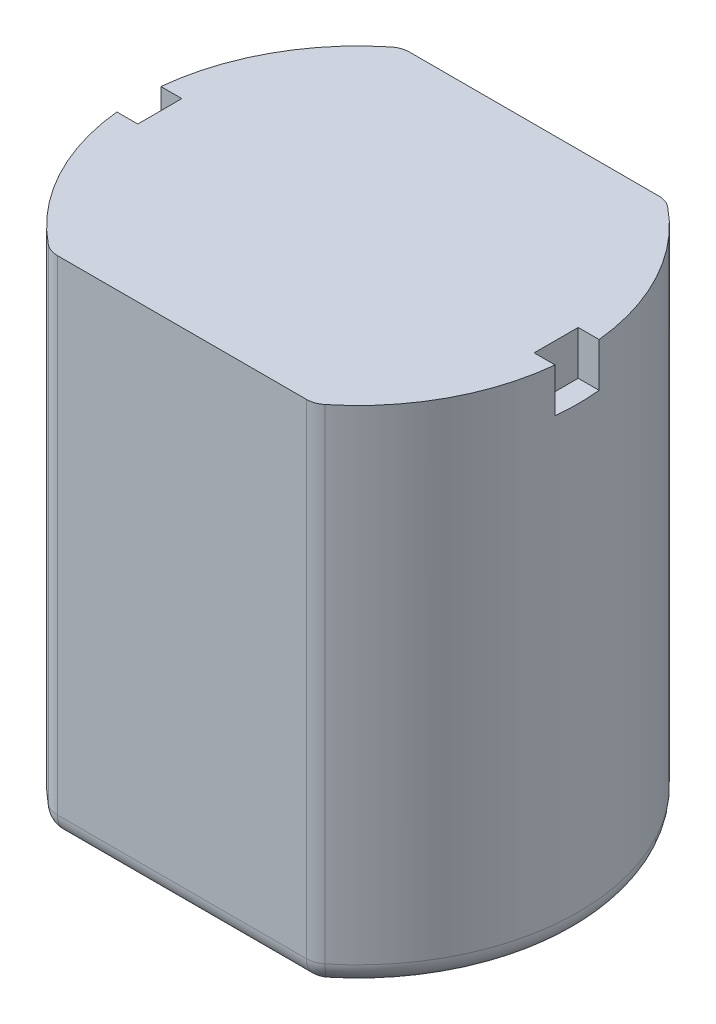
ISO-10303-21;
HEADER;
FILE_DESCRIPTION(('STEP AP214'),'2;1');
FILE_NAME('part.step','',(''),(''),'','','');
FILE_SCHEMA(('AUTOMOTIVE_DESIGN { 1 0 10303 214 1 1 1 1 }'));
ENDSEC;
DATA;
#1=APPLICATION_CONTEXT('core data for automotive mechanical design processes');
#2=APPLICATION_PROTOCOL_DEFINITION('international standard','automotive_design',2000,#1);
#3=PRODUCT_CONTEXT('',#1,'mechanical');
#4=PRODUCT('Part','Part','',(#3));
#5=PRODUCT_RELATED_PRODUCT_CATEGORY('part','',(#4));
#6=PRODUCT_DEFINITION_FORMATION('','',#4);
#7=PRODUCT_DEFINITION_CONTEXT('part definition',#1,'design');
#8=PRODUCT_DEFINITION('design','',#6,#7);
#9=PRODUCT_DEFINITION_SHAPE('','',#8);
#10=(LENGTH_UNIT() NAMED_UNIT(*) SI_UNIT(.MILLI.,.METRE.));
#11=(NAMED_UNIT(*) PLANE_ANGLE_UNIT() SI_UNIT($,.RADIAN.));
#12=(NAMED_UNIT(*) SI_UNIT($,.STERADIAN.) SOLID_ANGLE_UNIT());
#13=UNCERTAINTY_MEASURE_WITH_UNIT(LENGTH_MEASURE(1.E-05),#10,'distance_accuracy_value','');
#14=(GEOMETRIC_REPRESENTATION_CONTEXT(3) GLOBAL_UNCERTAINTY_ASSIGNED_CONTEXT((#13)) GLOBAL_UNIT_ASSIGNED_CONTEXT((#10,
#11,#12)) REPRESENTATION_CONTEXT('',''));
#15=CARTESIAN_POINT('',(0.,0.,0.));
#16=DIRECTION('',(0.,0.,1.));
#17=DIRECTION('',(1.,0.,0.));
#18=AXIS2_PLACEMENT_3D('',#15,#16,#17);
#19=CARTESIAN_POINT('',(0.,11.5,0.));
#20=DIRECTION('',(0.,-1.,0.));
#21=DIRECTION('',(0.,0.,-1.));
#22=AXIS2_PLACEMENT_3D('',#19,#20,#21);
#23=CYLINDRICAL_SURFACE('',#22,5.);
#24=DIRECTION('',(0.,-1.,0.));
#25=VECTOR('',#24,1.);
#26=CARTESIAN_POINT('',(-3.14269680527354,11.5,-3.88888888888889));
#27=LINE('',#26,#25);
#28=CARTESIAN_POINT('',(-3.14269680527354,11.5,-3.88888888888889));
#29=VERTEX_POINT('',#28);
#30=CARTESIAN_POINT('',(-3.14269680527354,0.5,-3.88888888888889));
#31=VERTEX_POINT('',#30);
#32=EDGE_CURVE('E247',#29,#31,#27,.T.);
#33=ORIENTED_EDGE('',*,*,#32,.T.);
#34=CARTESIAN_POINT('',(0.,0.5,0.));
#35=DIRECTION('',(0.,1.,0.));
#36=DIRECTION('',(0.,0.,1.));
#37=AXIS2_PLACEMENT_3D('',#34,#35,#36);
#38=CIRCLE('',#37,5.);
#39=CARTESIAN_POINT('',(-3.14269680527354,0.5,3.88888888888889));
#40=VERTEX_POINT('',#39);
#41=EDGE_CURVE('E44',#31,#40,#38,.T.);
#42=ORIENTED_EDGE('',*,*,#41,.T.);
#43=DIRECTION('',(0.,-1.,0.));
#44=VECTOR('',#43,1.);
#45=CARTESIAN_POINT('',(-3.14269680527354,11.5,3.88888888888889));
#46=LINE('',#45,#44);
#47=CARTESIAN_POINT('',(-3.14269680527354,11.5,3.88888888888889));
#48=VERTEX_POINT('',#47);
#49=EDGE_CURVE('E245',#40,#48,#46,.F.);
#50=ORIENTED_EDGE('',*,*,#49,.T.);
#51=CARTESIAN_POINT('',(0.,11.5,0.));
#52=DIRECTION('',(0.,1.,0.));
#53=DIRECTION('',(0.,0.,1.));
#54=AXIS2_PLACEMENT_3D('',#51,#52,#53);
#55=CIRCLE('',#54,5.);
#56=CARTESIAN_POINT('',(-4.9749371855331,11.5,0.5));
#57=VERTEX_POINT('',#56);
#58=EDGE_CURVE('E238',#57,#48,#55,.T.);
#59=ORIENTED_EDGE('',*,*,#58,.F.);
#60=DIRECTION('',(0.,-1.,0.));
#61=VECTOR('',#60,1.);
#62=CARTESIAN_POINT('',(-4.9749371855331,11.5,0.5));
#63=LINE('',#62,#61);
#64=CARTESIAN_POINT('',(-4.9749371855331,10.5,0.5));
#65=VERTEX_POINT('',#64);
#66=EDGE_CURVE('E198',#65,#57,#63,.F.);
#67=ORIENTED_EDGE('',*,*,#66,.F.);
#68=CARTESIAN_POINT('',(0.,10.5,0.));
#69=DIRECTION('',(0.,1.,0.));
#70=DIRECTION('',(0.,0.,1.));
#71=AXIS2_PLACEMENT_3D('',#68,#69,#70);
#72=CIRCLE('',#71,5.);
#73=CARTESIAN_POINT('',(-4.9749371855331,10.5,-0.5));
#74=VERTEX_POINT('',#73);
#75=EDGE_CURVE('E243',#74,#65,#72,.T.);
#76=ORIENTED_EDGE('',*,*,#75,.F.);
#77=DIRECTION('',(0.,-1.,0.));
#78=VECTOR('',#77,1.);
#79=CARTESIAN_POINT('',(-4.9749371855331,11.5,-0.5));
#80=LINE('',#79,#78);
#81=CARTESIAN_POINT('',(-4.9749371855331,11.5,-0.5));
#82=VERTEX_POINT('',#81);
#83=EDGE_CURVE('E196',#82,#74,#80,.T.);
#84=ORIENTED_EDGE('',*,*,#83,.F.);
#85=EDGE_CURVE('E188',#29,#82,#55,.T.);
#86=ORIENTED_EDGE('',*,*,#85,.F.);
#87=EDGE_LOOP('',(#33,#42,#50,#59,#67,#76,#84,#86));
#88=FACE_BOUND('',#87,.T.);
#89=ADVANCED_FACE('F36',(#88),#23,.T.);
#90=CARTESIAN_POINT('',(0.,11.5,0.));
#91=DIRECTION('',(0.,1.,0.));
#92=DIRECTION('',(0.,0.,1.));
#93=AXIS2_PLACEMENT_3D('',#90,#91,#92);
#94=PLANE('',#93);
#95=DIRECTION('',(1.,0.,0.));
#96=VECTOR('',#95,1.);
#97=CARTESIAN_POINT('',(-3.,11.5,-4.));
#98=LINE('',#97,#96);
#99=CARTESIAN_POINT('',(-2.82842712474619,11.5,-4.));
#100=VERTEX_POINT('',#99);
#101=CARTESIAN_POINT('',(2.82842712474619,11.5,-4.));
#102=VERTEX_POINT('',#101);
#103=EDGE_CURVE('E229',#100,#102,#98,.T.);
#104=ORIENTED_EDGE('',*,*,#103,.F.);
#105=CARTESIAN_POINT('',(-2.82842712474619,11.5,-3.5));
#106=DIRECTION('',(0.,1.,0.));
#107=DIRECTION('',(0.,0.,1.));
#108=AXIS2_PLACEMENT_3D('',#105,#106,#107);
#109=CIRCLE('',#108,0.5);
#110=EDGE_CURVE('E259',#100,#29,#109,.T.);
#111=ORIENTED_EDGE('',*,*,#110,.T.);
#112=ORIENTED_EDGE('',*,*,#85,.T.);
#113=DIRECTION('',(-1.,0.,0.));
#114=VECTOR('',#113,1.);
#115=CARTESIAN_POINT('',(-4.5,11.5,-0.5));
#116=LINE('',#115,#114);
#117=CARTESIAN_POINT('',(-4.5,11.5,-0.5));
#118=VERTEX_POINT('',#117);
#119=EDGE_CURVE('E169',#118,#82,#116,.T.);
#120=ORIENTED_EDGE('',*,*,#119,.F.);
#121=DIRECTION('',(0.,0.,1.));
#122=VECTOR('',#121,1.);
#123=CARTESIAN_POINT('',(-4.5,11.5,0.5));
#124=LINE('',#123,#122);
#125=CARTESIAN_POINT('',(-4.5,11.5,0.5));
#126=VERTEX_POINT('',#125);
#127=EDGE_CURVE('E175',#118,#126,#124,.T.);
#128=ORIENTED_EDGE('',*,*,#127,.T.);
#129=DIRECTION('',(-1.,0.,0.));
#130=VECTOR('',#129,1.);
#131=CARTESIAN_POINT('',(-4.5,11.5,0.5));
#132=LINE('',#131,#130);
#133=EDGE_CURVE('E189',#126,#57,#132,.T.);
#134=ORIENTED_EDGE('',*,*,#133,.T.);
#135=ORIENTED_EDGE('',*,*,#58,.T.);
#136=CARTESIAN_POINT('',(-2.82842712474619,11.5,3.5));
#137=DIRECTION('',(0.,1.,0.));
#138=DIRECTION('',(0.,0.,1.));
#139=AXIS2_PLACEMENT_3D('',#136,#137,#138);
#140=CIRCLE('',#139,0.5);
#141=CARTESIAN_POINT('',(-2.82842712474619,11.5,4.));
#142=VERTEX_POINT('',#141);
#143=EDGE_CURVE('E255',#48,#142,#140,.T.);
#144=ORIENTED_EDGE('',*,*,#143,.T.);
#145=DIRECTION('',(1.,0.,0.));
#146=VECTOR('',#145,1.);
#147=CARTESIAN_POINT('',(-3.,11.5,4.));
#148=LINE('',#147,#146);
#149=CARTESIAN_POINT('',(2.82842712474619,11.5,4.));
#150=VERTEX_POINT('',#149);
#151=EDGE_CURVE('E235',#142,#150,#148,.T.);
#152=ORIENTED_EDGE('',*,*,#151,.T.);
#153=CARTESIAN_POINT('',(2.82842712474619,11.5,3.5));
#154=DIRECTION('',(0.,1.,0.));
#155=DIRECTION('',(0.,0.,1.));
#156=AXIS2_PLACEMENT_3D('',#153,#154,#155);
#157=CIRCLE('',#156,0.5);
#158=CARTESIAN_POINT('',(3.14269680527354,11.5,3.88888888888889));
#159=VERTEX_POINT('',#158);
#160=EDGE_CURVE('E253',#150,#159,#157,.T.);
#161=ORIENTED_EDGE('',*,*,#160,.T.);
#162=CARTESIAN_POINT('',(0.,11.5,0.));
#163=DIRECTION('',(0.,1.,0.));
#164=DIRECTION('',(0.,0.,1.));
#165=AXIS2_PLACEMENT_3D('',#162,#163,#164);
#166=CIRCLE('',#165,5.);
#167=CARTESIAN_POINT('',(4.9749371855331,11.5,0.5));
#168=VERTEX_POINT('',#167);
#169=EDGE_CURVE('E233',#159,#168,#166,.T.);
#170=ORIENTED_EDGE('',*,*,#169,.T.);
#171=DIRECTION('',(1.,0.,0.));
#172=VECTOR('',#171,1.);
#173=CARTESIAN_POINT('',(4.5,11.5,0.5));
#174=LINE('',#173,#172);
#175=CARTESIAN_POINT('',(4.5,11.5,0.5));
#176=VERTEX_POINT('',#175);
#177=EDGE_CURVE('E212',#176,#168,#174,.T.);
#178=ORIENTED_EDGE('',*,*,#177,.F.);
#179=DIRECTION('',(0.,0.,1.));
#180=VECTOR('',#179,1.);
#181=CARTESIAN_POINT('',(4.5,11.5,0.5));
#182=LINE('',#181,#180);
#183=CARTESIAN_POINT('',(4.5,11.5,-0.5));
#184=VERTEX_POINT('',#183);
#185=EDGE_CURVE('E208',#184,#176,#182,.T.);
#186=ORIENTED_EDGE('',*,*,#185,.F.);
#187=DIRECTION('',(1.,0.,0.));
#188=VECTOR('',#187,1.);
#189=CARTESIAN_POINT('',(4.5,11.5,-0.5));
#190=LINE('',#189,#188);
#191=CARTESIAN_POINT('',(4.9749371855331,11.5,-0.5));
#192=VERTEX_POINT('',#191);
#193=EDGE_CURVE('E216',#184,#192,#190,.T.);
#194=ORIENTED_EDGE('',*,*,#193,.T.);
#195=CARTESIAN_POINT('',(3.14269680527354,11.5,-3.88888888888889));
#196=VERTEX_POINT('',#195);
#197=EDGE_CURVE('E232',#192,#196,#166,.T.);
#198=ORIENTED_EDGE('',*,*,#197,.T.);
#199=CARTESIAN_POINT('',(2.82842712474619,11.5,-3.5));
#200=DIRECTION('',(0.,1.,0.));
#201=DIRECTION('',(0.,0.,1.));
#202=AXIS2_PLACEMENT_3D('',#199,#200,#201);
#203=CIRCLE('',#202,0.5);
#204=EDGE_CURVE('E257',#196,#102,#203,.T.);
#205=ORIENTED_EDGE('',*,*,#204,.T.);
#206=EDGE_LOOP('',(#104,#111,#112,#120,#128,#134,#135,#144,#152,#161,#170,#178,#186,#194,#198,#205));
#207=FACE_BOUND('',#206,.T.);
#208=ADVANCED_FACE('F186',(#207),#94,.T.);
#209=CARTESIAN_POINT('',(-3.,11.5,-4.));
#210=DIRECTION('',(0.,0.,-1.));
#211=DIRECTION('',(-1.,0.,0.));
#212=AXIS2_PLACEMENT_3D('',#209,#210,#211);
#213=PLANE('',#212);
#214=DIRECTION('',(0.,1.,0.));
#215=VECTOR('',#214,1.);
#216=CARTESIAN_POINT('',(2.82842712474619,0.,-4.));
#217=LINE('',#216,#215);
#218=CARTESIAN_POINT('',(2.82842712474619,0.5,-4.));
#219=VERTEX_POINT('',#218);
#220=EDGE_CURVE('E249',#102,#219,#217,.F.);
#221=ORIENTED_EDGE('',*,*,#220,.T.);
#222=DIRECTION('',(1.,0.,0.));
#223=VECTOR('',#222,1.);
#224=CARTESIAN_POINT('',(-2.82842712474619,0.5,-4.));
#225=LINE('',#224,#223);
#226=CARTESIAN_POINT('',(-2.82842712474619,0.5,-4.));
#227=VERTEX_POINT('',#226);
#228=EDGE_CURVE('E59',#219,#227,#225,.F.);
#229=ORIENTED_EDGE('',*,*,#228,.T.);
#230=DIRECTION('',(0.,1.,0.));
#231=VECTOR('',#230,1.);
#232=CARTESIAN_POINT('',(-2.82842712474619,11.5,-4.));
#233=LINE('',#232,#231);
#234=EDGE_CURVE('E251',#227,#100,#233,.T.);
#235=ORIENTED_EDGE('',*,*,#234,.T.);
#236=ORIENTED_EDGE('',*,*,#103,.T.);
#237=EDGE_LOOP('',(#221,#229,#235,#236));
#238=FACE_BOUND('',#237,.T.);
#239=ADVANCED_FACE('F375',(#238),#213,.T.);
#240=CARTESIAN_POINT('',(-3.,11.5,4.));
#241=DIRECTION('',(0.,0.,-1.));
#242=DIRECTION('',(-1.,0.,0.));
#243=AXIS2_PLACEMENT_3D('',#240,#241,#242);
#244=PLANE('',#243);
#245=DIRECTION('',(0.,-1.,0.));
#246=VECTOR('',#245,1.);
#247=CARTESIAN_POINT('',(-2.82842712474619,11.5,4.));
#248=LINE('',#247,#246);
#249=CARTESIAN_POINT('',(-2.82842712474619,0.5,4.));
#250=VERTEX_POINT('',#249);
#251=EDGE_CURVE('E268',#142,#250,#248,.T.);
#252=ORIENTED_EDGE('',*,*,#251,.T.);
#253=DIRECTION('',(1.,0.,0.));
#254=VECTOR('',#253,1.);
#255=CARTESIAN_POINT('',(-3.,0.5,4.));
#256=LINE('',#255,#254);
#257=CARTESIAN_POINT('',(2.82842712474619,0.5,4.));
#258=VERTEX_POINT('',#257);
#259=EDGE_CURVE('E274',#250,#258,#256,.T.);
#260=ORIENTED_EDGE('',*,*,#259,.T.);
#261=DIRECTION('',(0.,-1.,0.));
#262=VECTOR('',#261,1.);
#263=CARTESIAN_POINT('',(2.82842712474619,11.5,4.));
#264=LINE('',#263,#262);
#265=EDGE_CURVE('E266',#258,#150,#264,.F.);
#266=ORIENTED_EDGE('',*,*,#265,.T.);
#267=ORIENTED_EDGE('',*,*,#151,.F.);
#268=EDGE_LOOP('',(#252,#260,#266,#267));
#269=FACE_BOUND('',#268,.T.);
#270=ADVANCED_FACE('F340',(#269),#244,.F.);
#271=CARTESIAN_POINT('',(0.,11.5,0.));
#272=DIRECTION('',(0.,-1.,0.));
#273=DIRECTION('',(0.,0.,-1.));
#274=AXIS2_PLACEMENT_3D('',#271,#272,#273);
#275=CYLINDRICAL_SURFACE('',#274,5.);
#276=DIRECTION('',(0.,-1.,0.));
#277=VECTOR('',#276,1.);
#278=CARTESIAN_POINT('',(3.14269680527354,11.5,3.88888888888889));
#279=LINE('',#278,#277);
#280=CARTESIAN_POINT('',(3.14269680527354,0.5,3.88888888888889));
#281=VERTEX_POINT('',#280);
#282=EDGE_CURVE('E261',#159,#281,#279,.T.);
#283=ORIENTED_EDGE('',*,*,#282,.T.);
#284=CARTESIAN_POINT('',(0.,0.5,0.));
#285=DIRECTION('',(0.,1.,0.));
#286=DIRECTION('',(0.,0.,1.));
#287=AXIS2_PLACEMENT_3D('',#284,#285,#286);
#288=CIRCLE('',#287,5.);
#289=CARTESIAN_POINT('',(3.14269680527354,0.5,-3.88888888888889));
#290=VERTEX_POINT('',#289);
#291=EDGE_CURVE('E287',#281,#290,#288,.T.);
#292=ORIENTED_EDGE('',*,*,#291,.T.);
#293=DIRECTION('',(0.,-1.,0.));
#294=VECTOR('',#293,1.);
#295=CARTESIAN_POINT('',(3.14269680527354,11.5,-3.88888888888889));
#296=LINE('',#295,#294);
#297=EDGE_CURVE('E264',#290,#196,#296,.F.);
#298=ORIENTED_EDGE('',*,*,#297,.T.);
#299=ORIENTED_EDGE('',*,*,#197,.F.);
#300=DIRECTION('',(0.,-1.,0.));
#301=VECTOR('',#300,1.);
#302=CARTESIAN_POINT('',(4.9749371855331,11.5,-0.5));
#303=LINE('',#302,#301);
#304=CARTESIAN_POINT('',(4.9749371855331,10.5,-0.5));
#305=VERTEX_POINT('',#304);
#306=EDGE_CURVE('E215',#192,#305,#303,.T.);
#307=ORIENTED_EDGE('',*,*,#306,.T.);
#308=CARTESIAN_POINT('',(0.,10.5,0.));
#309=DIRECTION('',(0.,-1.,0.));
#310=DIRECTION('',(0.,0.,-1.));
#311=AXIS2_PLACEMENT_3D('',#308,#309,#310);
#312=CIRCLE('',#311,5.);
#313=CARTESIAN_POINT('',(4.9749371855331,10.5,0.5));
#314=VERTEX_POINT('',#313);
#315=EDGE_CURVE('E240',#305,#314,#312,.T.);
#316=ORIENTED_EDGE('',*,*,#315,.T.);
#317=DIRECTION('',(0.,-1.,0.));
#318=VECTOR('',#317,1.);
#319=CARTESIAN_POINT('',(4.9749371855331,11.5,0.5));
#320=LINE('',#319,#318);
#321=EDGE_CURVE('E226',#314,#168,#320,.F.);
#322=ORIENTED_EDGE('',*,*,#321,.T.);
#323=ORIENTED_EDGE('',*,*,#169,.F.);
#324=EDGE_LOOP('',(#283,#292,#298,#299,#307,#316,#322,#323));
#325=FACE_BOUND('',#324,.T.);
#326=ADVANCED_FACE('F350',(#325),#275,.T.);
#327=CARTESIAN_POINT('',(0.,0.,0.));
#328=DIRECTION('',(0.,1.,0.));
#329=DIRECTION('',(0.,0.,1.));
#330=AXIS2_PLACEMENT_3D('',#327,#328,#329);
#331=PLANE('',#330);
#332=CARTESIAN_POINT('',(-3.,0.,0.));
#333=DIRECTION('',(0.,-1.,0.));
#334=DIRECTION('',(0.,0.,-1.));
#335=AXIS2_PLACEMENT_3D('',#332,#333,#334);
#336=CIRCLE('',#335,0.376312748616978);
#337=CARTESIAN_POINT('',(-3.,0.,-0.376312748616978));
#338=VERTEX_POINT('',#337);
#339=EDGE_CURVE('E707',#338,#338,#336,.T.);
#340=ORIENTED_EDGE('',*,*,#339,.F.);
#341=EDGE_LOOP('',(#340));
#342=FACE_BOUND('',#341,.T.);
#343=CARTESIAN_POINT('',(3.,0.,0.));
#344=DIRECTION('',(0.,-1.,0.));
#345=DIRECTION('',(0.,0.,-1.));
#346=AXIS2_PLACEMENT_3D('',#343,#344,#345);
#347=CIRCLE('',#346,0.431953984557101);
#348=CARTESIAN_POINT('',(3.,0.,-0.431953984557101));
#349=VERTEX_POINT('',#348);
#350=EDGE_CURVE('E717',#349,#349,#347,.T.);
#351=ORIENTED_EDGE('',*,*,#350,.F.);
#352=EDGE_LOOP('',(#351));
#353=FACE_BOUND('',#352,.T.);
#354=CARTESIAN_POINT('',(0.,0.,0.));
#355=DIRECTION('',(0.,1.,0.));
#356=DIRECTION('',(0.,0.,1.));
#357=AXIS2_PLACEMENT_3D('',#354,#355,#356);
#358=CIRCLE('',#357,2.);
#359=CARTESIAN_POINT('',(0.,0.,2.));
#360=VERTEX_POINT('',#359);
#361=EDGE_CURVE('E11',#360,#360,#358,.F.);
#362=ORIENTED_EDGE('',*,*,#361,.F.);
#363=EDGE_LOOP('',(#362));
#364=FACE_BOUND('',#363,.T.);
#365=CARTESIAN_POINT('',(0.,0.,0.));
#366=DIRECTION('',(0.,1.,0.));
#367=DIRECTION('',(0.,0.,1.));
#368=AXIS2_PLACEMENT_3D('',#365,#366,#367);
#369=CIRCLE('',#368,4.5);
#370=CARTESIAN_POINT('',(2.82842712474619,0.,-3.5));
#371=VERTEX_POINT('',#370);
#372=CARTESIAN_POINT('',(2.82842712474619,0.,3.5));
#373=VERTEX_POINT('',#372);
#374=EDGE_CURVE('E280',#371,#373,#369,.F.);
#375=ORIENTED_EDGE('',*,*,#374,.T.);
#376=DIRECTION('',(1.,0.,0.));
#377=VECTOR('',#376,1.);
#378=CARTESIAN_POINT('',(0.,0.,3.5));
#379=LINE('',#378,#377);
#380=CARTESIAN_POINT('',(-2.82842712474619,0.,3.5));
#381=VERTEX_POINT('',#380);
#382=EDGE_CURVE('E282',#373,#381,#379,.F.);
#383=ORIENTED_EDGE('',*,*,#382,.T.);
#384=CARTESIAN_POINT('',(0.,0.,0.));
#385=DIRECTION('',(0.,1.,0.));
#386=DIRECTION('',(0.,0.,1.));
#387=AXIS2_PLACEMENT_3D('',#384,#385,#386);
#388=CIRCLE('',#387,4.5);
#389=CARTESIAN_POINT('',(-2.82842712474619,0.,-3.5));
#390=VERTEX_POINT('',#389);
#391=EDGE_CURVE('E276',#381,#390,#388,.F.);
#392=ORIENTED_EDGE('',*,*,#391,.T.);
#393=DIRECTION('',(1.,0.,0.));
#394=VECTOR('',#393,1.);
#395=CARTESIAN_POINT('',(2.82842712474619,0.,-3.5));
#396=LINE('',#395,#394);
#397=EDGE_CURVE('E278',#390,#371,#396,.T.);
#398=ORIENTED_EDGE('',*,*,#397,.T.);
#399=EDGE_LOOP('',(#375,#383,#392,#398));
#400=FACE_BOUND('',#399,.T.);
#401=ADVANCED_FACE('F363',(#342,#353,#364,#400),#331,.F.);
#402=CARTESIAN_POINT('',(4.5,10.5,0.5));
#403=DIRECTION('',(0.,-1.,0.));
#404=DIRECTION('',(0.,0.,-1.));
#405=AXIS2_PLACEMENT_3D('',#402,#403,#404);
#406=PLANE('',#405);
#407=DIRECTION('',(1.,0.,0.));
#408=VECTOR('',#407,1.);
#409=CARTESIAN_POINT('',(4.5,10.5,-0.5));
#410=LINE('',#409,#408);
#411=CARTESIAN_POINT('',(4.5,10.5,-0.5));
#412=VERTEX_POINT('',#411);
#413=EDGE_CURVE('E219',#412,#305,#410,.T.);
#414=ORIENTED_EDGE('',*,*,#413,.F.);
#415=DIRECTION('',(0.,0.,-1.));
#416=VECTOR('',#415,1.);
#417=CARTESIAN_POINT('',(4.5,10.5,0.5));
#418=LINE('',#417,#416);
#419=CARTESIAN_POINT('',(4.5,10.5,0.5));
#420=VERTEX_POINT('',#419);
#421=EDGE_CURVE('E203',#420,#412,#418,.T.);
#422=ORIENTED_EDGE('',*,*,#421,.F.);
#423=DIRECTION('',(1.,0.,0.));
#424=VECTOR('',#423,1.);
#425=CARTESIAN_POINT('',(4.5,10.5,0.5));
#426=LINE('',#425,#424);
#427=EDGE_CURVE('E211',#420,#314,#426,.T.);
#428=ORIENTED_EDGE('',*,*,#427,.T.);
#429=ORIENTED_EDGE('',*,*,#315,.F.);
#430=EDGE_LOOP('',(#414,#422,#428,#429));
#431=FACE_BOUND('',#430,.T.);
#432=ADVANCED_FACE('F499',(#431),#406,.F.);
#433=CARTESIAN_POINT('',(4.5,11.5,0.5));
#434=DIRECTION('',(0.,0.,1.));
#435=DIRECTION('',(0.,-1.,0.));
#436=AXIS2_PLACEMENT_3D('',#433,#434,#435);
#437=PLANE('',#436);
#438=ORIENTED_EDGE('',*,*,#427,.F.);
#439=DIRECTION('',(0.,-1.,0.));
#440=VECTOR('',#439,1.);
#441=CARTESIAN_POINT('',(4.5,11.5,0.5));
#442=LINE('',#441,#440);
#443=EDGE_CURVE('E200',#176,#420,#442,.T.);
#444=ORIENTED_EDGE('',*,*,#443,.F.);
#445=ORIENTED_EDGE('',*,*,#177,.T.);
#446=ORIENTED_EDGE('',*,*,#321,.F.);
#447=EDGE_LOOP('',(#438,#444,#445,#446));
#448=FACE_BOUND('',#447,.T.);
#449=ADVANCED_FACE('F563',(#448),#437,.F.);
#450=CARTESIAN_POINT('',(4.5,11.5,-0.5));
#451=DIRECTION('',(0.,0.,-1.));
#452=DIRECTION('',(0.,1.,0.));
#453=AXIS2_PLACEMENT_3D('',#450,#451,#452);
#454=PLANE('',#453);
#455=ORIENTED_EDGE('',*,*,#193,.F.);
#456=DIRECTION('',(0.,1.,0.));
#457=VECTOR('',#456,1.);
#458=CARTESIAN_POINT('',(4.5,11.5,-0.5));
#459=LINE('',#458,#457);
#460=EDGE_CURVE('E206',#412,#184,#459,.T.);
#461=ORIENTED_EDGE('',*,*,#460,.F.);
#462=ORIENTED_EDGE('',*,*,#413,.T.);
#463=ORIENTED_EDGE('',*,*,#306,.F.);
#464=EDGE_LOOP('',(#455,#461,#462,#463));
#465=FACE_BOUND('',#464,.T.);
#466=ADVANCED_FACE('F559',(#465),#454,.F.);
#467=CARTESIAN_POINT('',(4.5,0.,0.));
#468=DIRECTION('',(1.,0.,0.));
#469=DIRECTION('',(0.,0.,-1.));
#470=AXIS2_PLACEMENT_3D('',#467,#468,#469);
#471=PLANE('',#470);
#472=ORIENTED_EDGE('',*,*,#443,.T.);
#473=ORIENTED_EDGE('',*,*,#421,.T.);
#474=ORIENTED_EDGE('',*,*,#460,.T.);
#475=ORIENTED_EDGE('',*,*,#185,.T.);
#476=EDGE_LOOP('',(#472,#473,#474,#475));
#477=FACE_BOUND('',#476,.T.);
#478=ADVANCED_FACE('F552',(#477),#471,.T.);
#479=CARTESIAN_POINT('',(-4.5,10.5,0.5));
#480=DIRECTION('',(0.,1.,0.));
#481=DIRECTION('',(0.,0.,1.));
#482=AXIS2_PLACEMENT_3D('',#479,#480,#481);
#483=PLANE('',#482);
#484=DIRECTION('',(-1.,0.,0.));
#485=VECTOR('',#484,1.);
#486=CARTESIAN_POINT('',(-4.5,10.5,-0.5));
#487=LINE('',#486,#485);
#488=CARTESIAN_POINT('',(-4.5,10.5,-0.5));
#489=VERTEX_POINT('',#488);
#490=EDGE_CURVE('E172',#489,#74,#487,.T.);
#491=ORIENTED_EDGE('',*,*,#490,.T.);
#492=ORIENTED_EDGE('',*,*,#75,.T.);
#493=DIRECTION('',(-1.,0.,0.));
#494=VECTOR('',#493,1.);
#495=CARTESIAN_POINT('',(-4.5,10.5,0.5));
#496=LINE('',#495,#494);
#497=CARTESIAN_POINT('',(-4.5,10.5,0.5));
#498=VERTEX_POINT('',#497);
#499=EDGE_CURVE('E191',#498,#65,#496,.T.);
#500=ORIENTED_EDGE('',*,*,#499,.F.);
#501=DIRECTION('',(0.,0.,-1.));
#502=VECTOR('',#501,1.);
#503=CARTESIAN_POINT('',(-4.5,10.5,0.5));
#504=LINE('',#503,#502);
#505=EDGE_CURVE('E174',#498,#489,#504,.T.);
#506=ORIENTED_EDGE('',*,*,#505,.T.);
#507=EDGE_LOOP('',(#491,#492,#500,#506));
#508=FACE_BOUND('',#507,.T.);
#509=ADVANCED_FACE('F549',(#508),#483,.T.);
#510=CARTESIAN_POINT('',(-4.5,11.5,0.5));
#511=DIRECTION('',(0.,0.,-1.));
#512=DIRECTION('',(0.,1.,0.));
#513=AXIS2_PLACEMENT_3D('',#510,#511,#512);
#514=PLANE('',#513);
#515=ORIENTED_EDGE('',*,*,#66,.T.);
#516=ORIENTED_EDGE('',*,*,#133,.F.);
#517=DIRECTION('',(0.,-1.,0.));
#518=VECTOR('',#517,1.);
#519=CARTESIAN_POINT('',(-4.5,11.5,0.5));
#520=LINE('',#519,#518);
#521=EDGE_CURVE('E180',#126,#498,#520,.T.);
#522=ORIENTED_EDGE('',*,*,#521,.T.);
#523=ORIENTED_EDGE('',*,*,#499,.T.);
#524=EDGE_LOOP('',(#515,#516,#522,#523));
#525=FACE_BOUND('',#524,.T.);
#526=ADVANCED_FACE('F327',(#525),#514,.T.);
#527=CARTESIAN_POINT('',(-4.5,11.5,-0.5));
#528=DIRECTION('',(0.,0.,1.));
#529=DIRECTION('',(0.,-1.,0.));
#530=AXIS2_PLACEMENT_3D('',#527,#528,#529);
#531=PLANE('',#530);
#532=ORIENTED_EDGE('',*,*,#83,.T.);
#533=ORIENTED_EDGE('',*,*,#490,.F.);
#534=DIRECTION('',(0.,1.,0.));
#535=VECTOR('',#534,1.);
#536=CARTESIAN_POINT('',(-4.5,11.5,-0.5));
#537=LINE('',#536,#535);
#538=EDGE_CURVE('E164',#489,#118,#537,.T.);
#539=ORIENTED_EDGE('',*,*,#538,.T.);
#540=ORIENTED_EDGE('',*,*,#119,.T.);
#541=EDGE_LOOP('',(#532,#533,#539,#540));
#542=FACE_BOUND('',#541,.T.);
#543=ADVANCED_FACE('F167',(#542),#531,.T.);
#544=CARTESIAN_POINT('',(-4.5,0.,0.));
#545=DIRECTION('',(-1.,0.,0.));
#546=DIRECTION('',(0.,0.,-1.));
#547=AXIS2_PLACEMENT_3D('',#544,#545,#546);
#548=PLANE('',#547);
#549=ORIENTED_EDGE('',*,*,#521,.F.);
#550=ORIENTED_EDGE('',*,*,#127,.F.);
#551=ORIENTED_EDGE('',*,*,#538,.F.);
#552=ORIENTED_EDGE('',*,*,#505,.F.);
#553=EDGE_LOOP('',(#549,#550,#551,#552));
#554=FACE_BOUND('',#553,.T.);
#555=ADVANCED_FACE('F178',(#554),#548,.T.);
#556=CARTESIAN_POINT('',(-2.82842712474619,11.5,-3.5));
#557=DIRECTION('',(0.,-1.,0.));
#558=DIRECTION('',(0.,0.,-1.));
#559=AXIS2_PLACEMENT_3D('',#556,#557,#558);
#560=CYLINDRICAL_SURFACE('',#559,0.5);
#561=ORIENTED_EDGE('',*,*,#234,.F.);
#562=CARTESIAN_POINT('',(-2.82842712474619,0.5,-3.5));
#563=DIRECTION('',(0.,-1.,0.));
#564=DIRECTION('',(0.,0.,-1.));
#565=AXIS2_PLACEMENT_3D('',#562,#563,#564);
#566=CIRCLE('',#565,0.5);
#567=EDGE_CURVE('E51',#227,#31,#566,.F.);
#568=ORIENTED_EDGE('',*,*,#567,.T.);
#569=ORIENTED_EDGE('',*,*,#32,.F.);
#570=ORIENTED_EDGE('',*,*,#110,.F.);
#571=EDGE_LOOP('',(#561,#568,#569,#570));
#572=FACE_BOUND('',#571,.T.);
#573=ADVANCED_FACE('F378',(#572),#560,.T.);
#574=CARTESIAN_POINT('',(2.82842712474619,11.5,-3.5));
#575=DIRECTION('',(0.,-1.,0.));
#576=DIRECTION('',(0.,0.,-1.));
#577=AXIS2_PLACEMENT_3D('',#574,#575,#576);
#578=CYLINDRICAL_SURFACE('',#577,0.5);
#579=ORIENTED_EDGE('',*,*,#297,.F.);
#580=CARTESIAN_POINT('',(2.82842712474619,0.5,-3.5));
#581=DIRECTION('',(0.,-1.,0.));
#582=DIRECTION('',(0.,0.,-1.));
#583=AXIS2_PLACEMENT_3D('',#580,#581,#582);
#584=CIRCLE('',#583,0.5);
#585=EDGE_CURVE('E289',#290,#219,#584,.F.);
#586=ORIENTED_EDGE('',*,*,#585,.T.);
#587=ORIENTED_EDGE('',*,*,#220,.F.);
#588=ORIENTED_EDGE('',*,*,#204,.F.);
#589=EDGE_LOOP('',(#579,#586,#587,#588));
#590=FACE_BOUND('',#589,.T.);
#591=ADVANCED_FACE('F373',(#590),#578,.T.);
#592=CARTESIAN_POINT('',(-2.82842712474619,11.5,3.5));
#593=DIRECTION('',(0.,-1.,0.));
#594=DIRECTION('',(0.,0.,-1.));
#595=AXIS2_PLACEMENT_3D('',#592,#593,#594);
#596=CYLINDRICAL_SURFACE('',#595,0.5);
#597=ORIENTED_EDGE('',*,*,#49,.F.);
#598=CARTESIAN_POINT('',(-2.82842712474619,0.5,3.5));
#599=DIRECTION('',(0.,-1.,0.));
#600=DIRECTION('',(0.,0.,-1.));
#601=AXIS2_PLACEMENT_3D('',#598,#599,#600);
#602=CIRCLE('',#601,0.5);
#603=EDGE_CURVE('E271',#40,#250,#602,.F.);
#604=ORIENTED_EDGE('',*,*,#603,.T.);
#605=ORIENTED_EDGE('',*,*,#251,.F.);
#606=ORIENTED_EDGE('',*,*,#143,.F.);
#607=EDGE_LOOP('',(#597,#604,#605,#606));
#608=FACE_BOUND('',#607,.T.);
#609=ADVANCED_FACE('F337',(#608),#596,.T.);
#610=CARTESIAN_POINT('',(2.82842712474619,11.5,3.5));
#611=DIRECTION('',(0.,-1.,0.));
#612=DIRECTION('',(0.,0.,-1.));
#613=AXIS2_PLACEMENT_3D('',#610,#611,#612);
#614=CYLINDRICAL_SURFACE('',#613,0.5);
#615=ORIENTED_EDGE('',*,*,#265,.F.);
#616=CARTESIAN_POINT('',(2.82842712474619,0.5,3.5));
#617=DIRECTION('',(0.,-1.,0.));
#618=DIRECTION('',(0.,0.,-1.));
#619=AXIS2_PLACEMENT_3D('',#616,#617,#618);
#620=CIRCLE('',#619,0.5);
#621=EDGE_CURVE('E285',#258,#281,#620,.F.);
#622=ORIENTED_EDGE('',*,*,#621,.T.);
#623=ORIENTED_EDGE('',*,*,#282,.F.);
#624=ORIENTED_EDGE('',*,*,#160,.F.);
#625=EDGE_LOOP('',(#615,#622,#623,#624));
#626=FACE_BOUND('',#625,.T.);
#627=ADVANCED_FACE('F347',(#626),#614,.T.);
#628=CARTESIAN_POINT('',(2.82842712474619,0.5,-3.5));
#629=DIRECTION('',(0.,1.,0.));
#630=DIRECTION('',(0.,0.,1.));
#631=AXIS2_PLACEMENT_3D('',#628,#629,#630);
#632=SPHERICAL_SURFACE('',#631,0.5);
#633=CARTESIAN_POINT('',(2.82842712474619,0.5,-3.5));
#634=DIRECTION('',(-1.,0.,0.));
#635=DIRECTION('',(0.,0.,1.));
#636=AXIS2_PLACEMENT_3D('',#633,#634,#635);
#637=CIRCLE('',#636,0.5);
#638=EDGE_CURVE('E311',#219,#371,#637,.T.);
#639=ORIENTED_EDGE('',*,*,#638,.F.);
#640=ORIENTED_EDGE('',*,*,#585,.F.);
#641=CARTESIAN_POINT('',(2.82842712474619,0.5,-3.5));
#642=DIRECTION('',(0.777777777777778,0.,0.628539361054709));
#643=DIRECTION('',(0.628539361054709,0.,-0.777777777777778));
#644=AXIS2_PLACEMENT_3D('',#641,#642,#643);
#645=CIRCLE('',#644,0.5);
#646=EDGE_CURVE('E313',#371,#290,#645,.T.);
#647=ORIENTED_EDGE('',*,*,#646,.F.);
#648=EDGE_LOOP('',(#639,#640,#647));
#649=FACE_BOUND('',#648,.T.);
#650=ADVANCED_FACE('F38',(#649),#632,.T.);
#651=CARTESIAN_POINT('',(0.,0.5,0.));
#652=DIRECTION('',(0.,1.,0.));
#653=DIRECTION('',(0.,0.,1.));
#654=AXIS2_PLACEMENT_3D('',#651,#652,#653);
#655=TOROIDAL_SURFACE('',#654,4.5,0.5);
#656=ORIENTED_EDGE('',*,*,#646,.T.);
#657=ORIENTED_EDGE('',*,*,#291,.F.);
#658=CARTESIAN_POINT('',(2.82842712474619,0.5,3.5));
#659=DIRECTION('',(-0.777777777777778,0.,0.628539361054709));
#660=DIRECTION('',(0.628539361054709,0.,0.777777777777778));
#661=AXIS2_PLACEMENT_3D('',#658,#659,#660);
#662=CIRCLE('',#661,0.5);
#663=EDGE_CURVE('E308',#373,#281,#662,.T.);
#664=ORIENTED_EDGE('',*,*,#663,.F.);
#665=ORIENTED_EDGE('',*,*,#374,.F.);
#666=EDGE_LOOP('',(#656,#657,#664,#665));
#667=FACE_BOUND('',#666,.T.);
#668=ADVANCED_FACE('F353',(#667),#655,.T.);
#669=CARTESIAN_POINT('',(0.,0.5,-3.5));
#670=DIRECTION('',(-1.,0.,0.));
#671=DIRECTION('',(0.,0.,1.));
#672=AXIS2_PLACEMENT_3D('',#669,#670,#671);
#673=CYLINDRICAL_SURFACE('',#672,0.5);
#674=ORIENTED_EDGE('',*,*,#638,.T.);
#675=ORIENTED_EDGE('',*,*,#397,.F.);
#676=CARTESIAN_POINT('',(-2.82842712474619,0.5,-3.5));
#677=DIRECTION('',(-1.,0.,0.));
#678=DIRECTION('',(0.,0.,1.));
#679=AXIS2_PLACEMENT_3D('',#676,#677,#678);
#680=CIRCLE('',#679,0.5);
#681=EDGE_CURVE('E305',#227,#390,#680,.T.);
#682=ORIENTED_EDGE('',*,*,#681,.F.);
#683=ORIENTED_EDGE('',*,*,#228,.F.);
#684=EDGE_LOOP('',(#674,#675,#682,#683));
#685=FACE_BOUND('',#684,.T.);
#686=ADVANCED_FACE('F368',(#685),#673,.T.);
#687=CARTESIAN_POINT('',(2.82842712474619,0.5,3.5));
#688=DIRECTION('',(0.,1.,0.));
#689=DIRECTION('',(0.,0.,1.));
#690=AXIS2_PLACEMENT_3D('',#687,#688,#689);
#691=SPHERICAL_SURFACE('',#690,0.5);
#692=ORIENTED_EDGE('',*,*,#663,.T.);
#693=ORIENTED_EDGE('',*,*,#621,.F.);
#694=CARTESIAN_POINT('',(2.82842712474619,0.5,3.5));
#695=DIRECTION('',(-1.,0.,0.));
#696=DIRECTION('',(0.,0.,1.));
#697=AXIS2_PLACEMENT_3D('',#694,#695,#696);
#698=CIRCLE('',#697,0.5);
#699=EDGE_CURVE('E302',#373,#258,#698,.T.);
#700=ORIENTED_EDGE('',*,*,#699,.F.);
#701=EDGE_LOOP('',(#692,#693,#700));
#702=FACE_BOUND('',#701,.T.);
#703=ADVANCED_FACE('F356',(#702),#691,.T.);
#704=CARTESIAN_POINT('',(-2.82842712474619,0.5,-3.5));
#705=DIRECTION('',(0.,1.,0.));
#706=DIRECTION('',(0.,0.,1.));
#707=AXIS2_PLACEMENT_3D('',#704,#705,#706);
#708=SPHERICAL_SURFACE('',#707,0.5);
#709=ORIENTED_EDGE('',*,*,#567,.F.);
#710=ORIENTED_EDGE('',*,*,#681,.T.);
#711=CARTESIAN_POINT('',(-2.82842712474619,0.5,-3.5));
#712=DIRECTION('',(-0.777777777777778,0.,0.628539361054708));
#713=DIRECTION('',(0.628539361054709,0.,0.777777777777778));
#714=AXIS2_PLACEMENT_3D('',#711,#712,#713);
#715=CIRCLE('',#714,0.5);
#716=EDGE_CURVE('E299',#31,#390,#715,.T.);
#717=ORIENTED_EDGE('',*,*,#716,.F.);
#718=EDGE_LOOP('',(#709,#710,#717));
#719=FACE_BOUND('',#718,.T.);
#720=ADVANCED_FACE('F382',(#719),#708,.T.);
#721=CARTESIAN_POINT('',(-3.,0.5,3.5));
#722=DIRECTION('',(1.,0.,0.));
#723=DIRECTION('',(0.,0.,-1.));
#724=AXIS2_PLACEMENT_3D('',#721,#722,#723);
#725=CYLINDRICAL_SURFACE('',#724,0.5);
#726=ORIENTED_EDGE('',*,*,#699,.T.);
#727=ORIENTED_EDGE('',*,*,#259,.F.);
#728=CARTESIAN_POINT('',(-2.82842712474619,0.5,3.5));
#729=DIRECTION('',(-1.,0.,0.));
#730=DIRECTION('',(0.,0.,1.));
#731=AXIS2_PLACEMENT_3D('',#728,#729,#730);
#732=CIRCLE('',#731,0.5);
#733=EDGE_CURVE('E296',#381,#250,#732,.T.);
#734=ORIENTED_EDGE('',*,*,#733,.F.);
#735=ORIENTED_EDGE('',*,*,#382,.F.);
#736=EDGE_LOOP('',(#726,#727,#734,#735));
#737=FACE_BOUND('',#736,.T.);
#738=ADVANCED_FACE('F360',(#737),#725,.T.);
#739=CARTESIAN_POINT('',(0.,0.5,0.));
#740=DIRECTION('',(0.,1.,0.));
#741=DIRECTION('',(0.,0.,1.));
#742=AXIS2_PLACEMENT_3D('',#739,#740,#741);
#743=TOROIDAL_SURFACE('',#742,4.5,0.5);
#744=ORIENTED_EDGE('',*,*,#716,.T.);
#745=ORIENTED_EDGE('',*,*,#391,.F.);
#746=CARTESIAN_POINT('',(-2.82842712474619,0.5,3.5));
#747=DIRECTION('',(0.777777777777778,0.,0.628539361054709));
#748=DIRECTION('',(0.628539361054709,0.,-0.777777777777778));
#749=AXIS2_PLACEMENT_3D('',#746,#747,#748);
#750=CIRCLE('',#749,0.5);
#751=EDGE_CURVE('E294',#40,#381,#750,.T.);
#752=ORIENTED_EDGE('',*,*,#751,.F.);
#753=ORIENTED_EDGE('',*,*,#41,.F.);
#754=EDGE_LOOP('',(#744,#745,#752,#753));
#755=FACE_BOUND('',#754,.T.);
#756=ADVANCED_FACE('F385',(#755),#743,.T.);
#757=CARTESIAN_POINT('',(-2.82842712474619,0.5,3.5));
#758=DIRECTION('',(0.,1.,0.));
#759=DIRECTION('',(0.,0.,1.));
#760=AXIS2_PLACEMENT_3D('',#757,#758,#759);
#761=SPHERICAL_SURFACE('',#760,0.5);
#762=ORIENTED_EDGE('',*,*,#733,.T.);
#763=ORIENTED_EDGE('',*,*,#603,.F.);
#764=ORIENTED_EDGE('',*,*,#751,.T.);
#765=EDGE_LOOP('',(#762,#763,#764));
#766=FACE_BOUND('',#765,.T.);
#767=ADVANCED_FACE('F387',(#766),#761,.T.);
#768=CARTESIAN_POINT('',(0.,-0.25,0.));
#769=DIRECTION('',(0.,1.,0.));
#770=DIRECTION('',(0.,0.,1.));
#771=AXIS2_PLACEMENT_3D('',#768,#769,#770);
#772=CYLINDRICAL_SURFACE('',#771,2.);
#773=CARTESIAN_POINT('',(0.,-0.25,0.));
#774=DIRECTION('',(0.,-1.,0.));
#775=DIRECTION('',(0.,0.,-1.));
#776=AXIS2_PLACEMENT_3D('',#773,#774,#775);
#777=CIRCLE('',#776,2.);
#778=CARTESIAN_POINT('',(0.,-0.25,-2.));
#779=VERTEX_POINT('',#778);
#780=EDGE_CURVE('E297',#779,#779,#777,.T.);
#781=ORIENTED_EDGE('',*,*,#780,.F.);
#782=EDGE_LOOP('',(#781));
#783=FACE_BOUND('',#782,.T.);
#784=ORIENTED_EDGE('',*,*,#361,.T.);
#785=EDGE_LOOP('',(#784));
#786=FACE_BOUND('',#785,.T.);
#787=ADVANCED_FACE('F389',(#783,#786),#772,.T.);
#788=CARTESIAN_POINT('',(0.,-0.25,0.));
#789=DIRECTION('',(0.,-1.,0.));
#790=DIRECTION('',(0.,0.,-1.));
#791=AXIS2_PLACEMENT_3D('',#788,#789,#790);
#792=PLANE('',#791);
#793=CARTESIAN_POINT('',(0.,-0.25,0.));
#794=DIRECTION('',(0.,-1.,0.));
#795=DIRECTION('',(0.,0.,-1.));
#796=AXIS2_PLACEMENT_3D('',#793,#794,#795);
#797=CIRCLE('',#796,0.25);
#798=CARTESIAN_POINT('',(0.,-0.25,-0.25));
#799=VERTEX_POINT('',#798);
#800=EDGE_CURVE('E706',#799,#799,#797,.T.);
#801=ORIENTED_EDGE('',*,*,#800,.F.);
#802=EDGE_LOOP('',(#801));
#803=FACE_BOUND('',#802,.T.);
#804=ORIENTED_EDGE('',*,*,#780,.T.);
#805=EDGE_LOOP('',(#804));
#806=FACE_BOUND('',#805,.T.);
#807=ADVANCED_FACE('F395',(#803,#806),#792,.T.);
#808=CARTESIAN_POINT('',(0.,-2.75,0.));
#809=DIRECTION('',(0.,1.,0.));
#810=DIRECTION('',(0.,0.,1.));
#811=AXIS2_PLACEMENT_3D('',#808,#809,#810);
#812=CYLINDRICAL_SURFACE('',#811,0.25);
#813=CARTESIAN_POINT('',(0.,-2.75,0.));
#814=DIRECTION('',(0.,-1.,0.));
#815=DIRECTION('',(0.,0.,-1.));
#816=AXIS2_PLACEMENT_3D('',#813,#814,#815);
#817=CIRCLE('',#816,0.25);
#818=CARTESIAN_POINT('',(0.,-2.75,-0.25));
#819=VERTEX_POINT('',#818);
#820=EDGE_CURVE('E710',#819,#819,#817,.T.);
#821=ORIENTED_EDGE('',*,*,#820,.F.);
#822=EDGE_LOOP('',(#821));
#823=FACE_BOUND('',#822,.T.);
#824=ORIENTED_EDGE('',*,*,#800,.T.);
#825=EDGE_LOOP('',(#824));
#826=FACE_BOUND('',#825,.T.);
#827=ADVANCED_FACE('F466',(#823,#826),#812,.T.);
#828=CARTESIAN_POINT('',(0.,-2.75,0.));
#829=DIRECTION('',(0.,-1.,0.));
#830=DIRECTION('',(0.,0.,-1.));
#831=AXIS2_PLACEMENT_3D('',#828,#829,#830);
#832=PLANE('',#831);
#833=ORIENTED_EDGE('',*,*,#820,.T.);
#834=EDGE_LOOP('',(#833));
#835=FACE_BOUND('',#834,.T.);
#836=ADVANCED_FACE('F477',(#835),#832,.T.);
#837=CARTESIAN_POINT('',(3.,0.5,0.));
#838=DIRECTION('',(0.,-1.,0.));
#839=DIRECTION('',(0.,0.,-1.));
#840=AXIS2_PLACEMENT_3D('',#837,#838,#839);
#841=CYLINDRICAL_SURFACE('',#840,0.431953984557101);
#842=CARTESIAN_POINT('',(3.,0.5,0.));
#843=DIRECTION('',(0.,-1.,0.));
#844=DIRECTION('',(0.,0.,-1.));
#845=AXIS2_PLACEMENT_3D('',#842,#843,#844);
#846=CIRCLE('',#845,0.431953984557101);
#847=CARTESIAN_POINT('',(3.,0.5,-0.431953984557101));
#848=VERTEX_POINT('',#847);
#849=EDGE_CURVE('E712',#848,#848,#846,.T.);
#850=ORIENTED_EDGE('',*,*,#849,.F.);
#851=EDGE_LOOP('',(#850));
#852=FACE_BOUND('',#851,.T.);
#853=ORIENTED_EDGE('',*,*,#350,.T.);
#854=EDGE_LOOP('',(#853));
#855=FACE_BOUND('',#854,.T.);
#856=ADVANCED_FACE('F487',(#852,#855),#841,.F.);
#857=CARTESIAN_POINT('',(3.,0.5,0.));
#858=DIRECTION('',(0.,-1.,0.));
#859=DIRECTION('',(0.,0.,-1.));
#860=AXIS2_PLACEMENT_3D('',#857,#858,#859);
#861=PLANE('',#860);
#862=ORIENTED_EDGE('',*,*,#849,.T.);
#863=EDGE_LOOP('',(#862));
#864=FACE_BOUND('',#863,.T.);
#865=ADVANCED_FACE('F509',(#864),#861,.T.);
#866=CARTESIAN_POINT('',(-3.,0.5,0.));
#867=DIRECTION('',(0.,-1.,0.));
#868=DIRECTION('',(0.,0.,-1.));
#869=AXIS2_PLACEMENT_3D('',#866,#867,#868);
#870=CYLINDRICAL_SURFACE('',#869,0.376312748616978);
#871=CARTESIAN_POINT('',(-3.,0.5,0.));
#872=DIRECTION('',(0.,-1.,0.));
#873=DIRECTION('',(0.,0.,-1.));
#874=AXIS2_PLACEMENT_3D('',#871,#872,#873);
#875=CIRCLE('',#874,0.376312748616978);
#876=CARTESIAN_POINT('',(-3.,0.5,-0.376312748616978));
#877=VERTEX_POINT('',#876);
#878=EDGE_CURVE('E705',#877,#877,#875,.T.);
#879=ORIENTED_EDGE('',*,*,#878,.F.);
#880=EDGE_LOOP('',(#879));
#881=FACE_BOUND('',#880,.T.);
#882=ORIENTED_EDGE('',*,*,#339,.T.);
#883=EDGE_LOOP('',(#882));
#884=FACE_BOUND('',#883,.T.);
#885=ADVANCED_FACE('F520',(#881,#884),#870,.F.);
#886=CARTESIAN_POINT('',(-3.,0.5,0.));
#887=DIRECTION('',(0.,-1.,0.));
#888=DIRECTION('',(0.,0.,-1.));
#889=AXIS2_PLACEMENT_3D('',#886,#887,#888);
#890=PLANE('',#889);
#891=ORIENTED_EDGE('',*,*,#878,.T.);
#892=EDGE_LOOP('',(#891));
#893=FACE_BOUND('',#892,.T.);
#894=ADVANCED_FACE('F530',(#893),#890,.T.);
#895=CLOSED_SHELL('',(#89,#208,#239,#270,#326,#401,#432,#449,#466,#478,#509,#526,#543,#555,#573,
#591,#609,#627,#650,#668,#686,#703,#720,#738,#756,#767,#787,#807,#827,#836,#856,#865,#885,#894));
#896=MANIFOLD_SOLID_BREP('B2',#895);
#897=ADVANCED_BREP_SHAPE_REPRESENTATION('',(#18,#896),#14);
#898=SHAPE_DEFINITION_REPRESENTATION(#9,#897);
ENDSEC;
END-ISO-10303-21;
